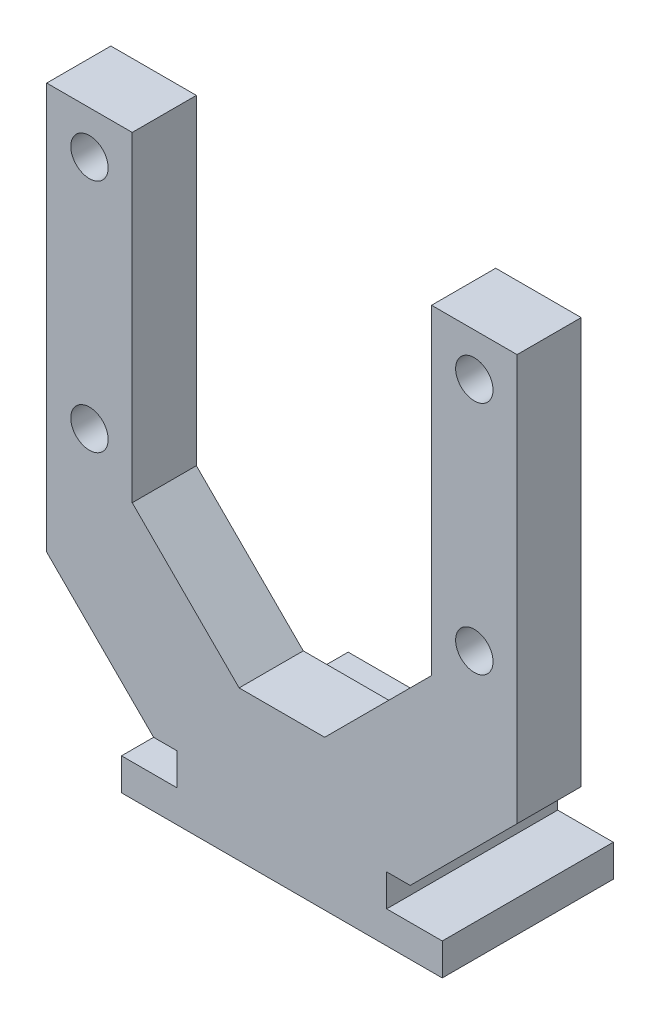
ISO-10303-21;
HEADER;
FILE_DESCRIPTION(('STEP AP214'),'2;1');
FILE_NAME('part.step','',(''),(''),'','','');
FILE_SCHEMA(('AUTOMOTIVE_DESIGN { 1 0 10303 214 1 1 1 1 }'));
ENDSEC;
DATA;
#1=APPLICATION_CONTEXT('core data for automotive mechanical design processes');
#2=APPLICATION_PROTOCOL_DEFINITION('international standard','automotive_design',2000,#1);
#3=PRODUCT_CONTEXT('',#1,'mechanical');
#4=PRODUCT('Part','Part','',(#3));
#5=PRODUCT_RELATED_PRODUCT_CATEGORY('part','',(#4));
#6=PRODUCT_DEFINITION_FORMATION('','',#4);
#7=PRODUCT_DEFINITION_CONTEXT('part definition',#1,'design');
#8=PRODUCT_DEFINITION('design','',#6,#7);
#9=PRODUCT_DEFINITION_SHAPE('','',#8);
#10=(LENGTH_UNIT() NAMED_UNIT(*) SI_UNIT(.MILLI.,.METRE.));
#11=(NAMED_UNIT(*) PLANE_ANGLE_UNIT() SI_UNIT($,.RADIAN.));
#12=(NAMED_UNIT(*) SI_UNIT($,.STERADIAN.) SOLID_ANGLE_UNIT());
#13=UNCERTAINTY_MEASURE_WITH_UNIT(LENGTH_MEASURE(1.E-05),#10,'distance_accuracy_value','');
#14=(GEOMETRIC_REPRESENTATION_CONTEXT(3) GLOBAL_UNCERTAINTY_ASSIGNED_CONTEXT((#13)) GLOBAL_UNIT_ASSIGNED_CONTEXT((#10,
#11,#12)) REPRESENTATION_CONTEXT('',''));
#15=CARTESIAN_POINT('',(0.,0.,0.));
#16=DIRECTION('',(0.,0.,1.));
#17=DIRECTION('',(1.,0.,0.));
#18=AXIS2_PLACEMENT_3D('',#15,#16,#17);
#19=CARTESIAN_POINT('',(4.9,0.,3.));
#20=DIRECTION('',(1.,0.,0.));
#21=DIRECTION('',(0.,1.,0.));
#22=AXIS2_PLACEMENT_3D('',#19,#20,#21);
#23=PLANE('',#22);
#24=DIRECTION('',(0.,0.,-1.));
#25=VECTOR('',#24,1.);
#26=CARTESIAN_POINT('',(4.9,1.5000000000001,3.));
#27=LINE('',#26,#25);
#28=CARTESIAN_POINT('',(4.9,1.5000000000001,3.));
#29=VERTEX_POINT('',#28);
#30=CARTESIAN_POINT('',(4.9,1.5000000000001,-5.));
#31=VERTEX_POINT('',#30);
#32=EDGE_CURVE('E209',#29,#31,#27,.T.);
#33=ORIENTED_EDGE('',*,*,#32,.T.);
#34=DIRECTION('',(0.,-1.,0.));
#35=VECTOR('',#34,1.);
#36=CARTESIAN_POINT('',(4.9,0.,-5.));
#37=LINE('',#36,#35);
#38=CARTESIAN_POINT('',(4.9,3.0000000000001,-5.));
#39=VERTEX_POINT('',#38);
#40=EDGE_CURVE('E207',#39,#31,#37,.T.);
#41=ORIENTED_EDGE('',*,*,#40,.F.);
#42=DIRECTION('',(0.,0.,1.));
#43=VECTOR('',#42,1.);
#44=CARTESIAN_POINT('',(4.9,3.0000000000001,-5.));
#45=LINE('',#44,#43);
#46=CARTESIAN_POINT('',(4.9,3.0000000000001,-0.999999999999997));
#47=VERTEX_POINT('',#46);
#48=EDGE_CURVE('E195',#39,#47,#45,.T.);
#49=ORIENTED_EDGE('',*,*,#48,.T.);
#50=DIRECTION('',(0.,0.707106781186551,0.707106781186544));
#51=VECTOR('',#50,1.);
#52=CARTESIAN_POINT('',(4.9,4.00000000000008,0.));
#53=LINE('',#52,#51);
#54=CARTESIAN_POINT('',(4.9,4.00000000000011,0.));
#55=VERTEX_POINT('',#54);
#56=EDGE_CURVE('E11',#47,#55,#53,.T.);
#57=ORIENTED_EDGE('',*,*,#56,.T.);
#58=DIRECTION('',(0.,1.,0.));
#59=VECTOR('',#58,1.);
#60=CARTESIAN_POINT('',(4.9,0.,0.));
#61=LINE('',#60,#59);
#62=CARTESIAN_POINT('',(4.9,3.0000000000001,0.));
#63=VERTEX_POINT('',#62);
#64=EDGE_CURVE('E55',#63,#55,#61,.T.);
#65=ORIENTED_EDGE('',*,*,#64,.F.);
#66=DIRECTION('',(0.,0.,-1.));
#67=VECTOR('',#66,1.);
#68=CARTESIAN_POINT('',(4.9,3.0000000000001,3.));
#69=LINE('',#68,#67);
#70=CARTESIAN_POINT('',(4.9,3.0000000000001,3.));
#71=VERTEX_POINT('',#70);
#72=EDGE_CURVE('E345',#71,#63,#69,.T.);
#73=ORIENTED_EDGE('',*,*,#72,.F.);
#74=DIRECTION('',(0.,-1.,0.));
#75=VECTOR('',#74,1.);
#76=CARTESIAN_POINT('',(4.9,0.,3.));
#77=LINE('',#76,#75);
#78=EDGE_CURVE('E239',#71,#29,#77,.T.);
#79=ORIENTED_EDGE('',*,*,#78,.T.);
#80=EDGE_LOOP('',(#33,#41,#49,#57,#65,#73,#79));
#81=FACE_BOUND('',#80,.T.);
#82=ADVANCED_FACE('F40',(#81),#23,.T.);
#83=CARTESIAN_POINT('',(0.,3.00000000000005,3.));
#84=DIRECTION('',(0.,-1.,0.));
#85=DIRECTION('',(1.,0.,0.));
#86=AXIS2_PLACEMENT_3D('',#83,#84,#85);
#87=PLANE('',#86);
#88=DIRECTION('',(-1.,0.,0.));
#89=VECTOR('',#88,1.);
#90=CARTESIAN_POINT('',(0.,3.00000000000005,0.));
#91=LINE('',#90,#89);
#92=CARTESIAN_POINT('',(6.00000000000014,3.00000000000011,0.));
#93=VERTEX_POINT('',#92);
#94=EDGE_CURVE('E237',#93,#63,#91,.T.);
#95=ORIENTED_EDGE('',*,*,#94,.F.);
#96=DIRECTION('',(0.,0.,1.));
#97=VECTOR('',#96,1.);
#98=CARTESIAN_POINT('',(6.00000000000014,3.00000000000011,3.));
#99=LINE('',#98,#97);
#100=CARTESIAN_POINT('',(6.00000000000014,3.00000000000011,3.));
#101=VERTEX_POINT('',#100);
#102=EDGE_CURVE('E364',#93,#101,#99,.T.);
#103=ORIENTED_EDGE('',*,*,#102,.T.);
#104=DIRECTION('',(-1.,0.,0.));
#105=VECTOR('',#104,1.);
#106=CARTESIAN_POINT('',(0.,3.00000000000005,3.));
#107=LINE('',#106,#105);
#108=EDGE_CURVE('E241',#101,#71,#107,.T.);
#109=ORIENTED_EDGE('',*,*,#108,.T.);
#110=ORIENTED_EDGE('',*,*,#72,.T.);
#111=EDGE_LOOP('',(#95,#103,#109,#110));
#112=FACE_BOUND('',#111,.T.);
#113=ADVANCED_FACE('F457',(#112),#87,.T.);
#114=CARTESIAN_POINT('',(11.,0.,3.));
#115=DIRECTION('',(-1.,0.,0.));
#116=DIRECTION('',(0.,-1.,0.));
#117=AXIS2_PLACEMENT_3D('',#114,#115,#116);
#118=PLANE('',#117);
#119=DIRECTION('',(0.,1.,0.));
#120=VECTOR('',#119,1.);
#121=CARTESIAN_POINT('',(11.,0.,3.));
#122=LINE('',#121,#120);
#123=CARTESIAN_POINT('',(11.,8.00000000000004,3.));
#124=VERTEX_POINT('',#123);
#125=CARTESIAN_POINT('',(11.,27.,3.));
#126=VERTEX_POINT('',#125);
#127=EDGE_CURVE('E244',#124,#126,#122,.T.);
#128=ORIENTED_EDGE('',*,*,#127,.F.);
#129=DIRECTION('',(0.,0.,-1.));
#130=VECTOR('',#129,1.);
#131=CARTESIAN_POINT('',(11.,8.00000000000004,0.));
#132=LINE('',#131,#130);
#133=CARTESIAN_POINT('',(11.,8.00000000000004,0.));
#134=VERTEX_POINT('',#133);
#135=EDGE_CURVE('E361',#124,#134,#132,.T.);
#136=ORIENTED_EDGE('',*,*,#135,.T.);
#137=DIRECTION('',(0.,1.,0.));
#138=VECTOR('',#137,1.);
#139=CARTESIAN_POINT('',(11.,0.,0.));
#140=LINE('',#139,#138);
#141=CARTESIAN_POINT('',(11.,27.,0.));
#142=VERTEX_POINT('',#141);
#143=EDGE_CURVE('E290',#134,#142,#140,.T.);
#144=ORIENTED_EDGE('',*,*,#143,.T.);
#145=DIRECTION('',(0.,0.,-1.));
#146=VECTOR('',#145,1.);
#147=CARTESIAN_POINT('',(11.,27.,3.));
#148=LINE('',#147,#146);
#149=EDGE_CURVE('E342',#126,#142,#148,.T.);
#150=ORIENTED_EDGE('',*,*,#149,.F.);
#151=EDGE_LOOP('',(#128,#136,#144,#150));
#152=FACE_BOUND('',#151,.T.);
#153=ADVANCED_FACE('F449',(#152),#118,.F.);
#154=CARTESIAN_POINT('',(0.,27.,3.));
#155=DIRECTION('',(0.,-1.,0.));
#156=DIRECTION('',(0.,0.,-1.));
#157=AXIS2_PLACEMENT_3D('',#154,#155,#156);
#158=PLANE('',#157);
#159=DIRECTION('',(-1.,0.,0.));
#160=VECTOR('',#159,1.);
#161=CARTESIAN_POINT('',(0.,27.,0.));
#162=LINE('',#161,#160);
#163=CARTESIAN_POINT('',(6.99999999999996,27.,0.));
#164=VERTEX_POINT('',#163);
#165=EDGE_CURVE('E293',#142,#164,#162,.T.);
#166=ORIENTED_EDGE('',*,*,#165,.T.);
#167=DIRECTION('',(0.,0.,-1.));
#168=VECTOR('',#167,1.);
#169=CARTESIAN_POINT('',(6.99999999999996,27.,3.));
#170=LINE('',#169,#168);
#171=CARTESIAN_POINT('',(6.99999999999996,27.,3.));
#172=VERTEX_POINT('',#171);
#173=EDGE_CURVE('E339',#172,#164,#170,.T.);
#174=ORIENTED_EDGE('',*,*,#173,.F.);
#175=DIRECTION('',(-1.,0.,0.));
#176=VECTOR('',#175,1.);
#177=CARTESIAN_POINT('',(0.,27.,3.));
#178=LINE('',#177,#176);
#179=EDGE_CURVE('E247',#126,#172,#178,.T.);
#180=ORIENTED_EDGE('',*,*,#179,.F.);
#181=ORIENTED_EDGE('',*,*,#149,.T.);
#182=EDGE_LOOP('',(#166,#174,#180,#181));
#183=FACE_BOUND('',#182,.T.);
#184=ADVANCED_FACE('F443',(#183),#158,.F.);
#185=CARTESIAN_POINT('',(6.99999999999988,0.,3.));
#186=DIRECTION('',(-1.,0.,0.));
#187=DIRECTION('',(0.,-1.,0.));
#188=AXIS2_PLACEMENT_3D('',#185,#186,#187);
#189=PLANE('',#188);
#190=DIRECTION('',(0.,1.,0.));
#191=VECTOR('',#190,1.);
#192=CARTESIAN_POINT('',(6.99999999999988,0.,0.));
#193=LINE('',#192,#191);
#194=CARTESIAN_POINT('',(6.99999999999992,12.,0.));
#195=VERTEX_POINT('',#194);
#196=EDGE_CURVE('E296',#195,#164,#193,.T.);
#197=ORIENTED_EDGE('',*,*,#196,.F.);
#198=DIRECTION('',(0.,0.,1.));
#199=VECTOR('',#198,1.);
#200=CARTESIAN_POINT('',(6.99999999999992,12.,3.));
#201=LINE('',#200,#199);
#202=CARTESIAN_POINT('',(6.99999999999992,12.,3.));
#203=VERTEX_POINT('',#202);
#204=EDGE_CURVE('E371',#195,#203,#201,.T.);
#205=ORIENTED_EDGE('',*,*,#204,.T.);
#206=DIRECTION('',(0.,1.,0.));
#207=VECTOR('',#206,1.);
#208=CARTESIAN_POINT('',(6.99999999999988,0.,3.));
#209=LINE('',#208,#207);
#210=EDGE_CURVE('E250',#203,#172,#209,.T.);
#211=ORIENTED_EDGE('',*,*,#210,.T.);
#212=ORIENTED_EDGE('',*,*,#173,.T.);
#213=EDGE_LOOP('',(#197,#205,#211,#212));
#214=FACE_BOUND('',#213,.T.);
#215=ADVANCED_FACE('F438',(#214),#189,.T.);
#216=CARTESIAN_POINT('',(0.,7.,3.));
#217=DIRECTION('',(0.,1.,0.));
#218=DIRECTION('',(0.,0.,1.));
#219=AXIS2_PLACEMENT_3D('',#216,#217,#218);
#220=PLANE('',#219);
#221=DIRECTION('',(1.,0.,0.));
#222=VECTOR('',#221,1.);
#223=CARTESIAN_POINT('',(0.,7.,3.));
#224=LINE('',#223,#222);
#225=CARTESIAN_POINT('',(-1.99999999999992,7.,3.));
#226=VERTEX_POINT('',#225);
#227=CARTESIAN_POINT('',(1.99999999999986,7.,3.));
#228=VERTEX_POINT('',#227);
#229=EDGE_CURVE('E252',#226,#228,#224,.T.);
#230=ORIENTED_EDGE('',*,*,#229,.T.);
#231=DIRECTION('',(0.,0.,-1.));
#232=VECTOR('',#231,1.);
#233=CARTESIAN_POINT('',(1.99999999999986,7.,0.));
#234=LINE('',#233,#232);
#235=CARTESIAN_POINT('',(1.99999999999986,7.,0.));
#236=VERTEX_POINT('',#235);
#237=EDGE_CURVE('E368',#228,#236,#234,.T.);
#238=ORIENTED_EDGE('',*,*,#237,.T.);
#239=DIRECTION('',(1.,0.,0.));
#240=VECTOR('',#239,1.);
#241=CARTESIAN_POINT('',(0.,7.,0.));
#242=LINE('',#241,#240);
#243=CARTESIAN_POINT('',(-1.99999999999992,7.,0.));
#244=VERTEX_POINT('',#243);
#245=EDGE_CURVE('E298',#244,#236,#242,.T.);
#246=ORIENTED_EDGE('',*,*,#245,.F.);
#247=DIRECTION('',(0.,0.,1.));
#248=VECTOR('',#247,1.);
#249=CARTESIAN_POINT('',(-1.99999999999992,7.,3.));
#250=LINE('',#249,#248);
#251=EDGE_CURVE('E366',#244,#226,#250,.T.);
#252=ORIENTED_EDGE('',*,*,#251,.T.);
#253=EDGE_LOOP('',(#230,#238,#246,#252));
#254=FACE_BOUND('',#253,.T.);
#255=ADVANCED_FACE('F428',(#254),#220,.T.);
#256=CARTESIAN_POINT('',(-6.99999999999988,0.,3.));
#257=DIRECTION('',(1.,0.,0.));
#258=DIRECTION('',(0.,1.,0.));
#259=AXIS2_PLACEMENT_3D('',#256,#257,#258);
#260=PLANE('',#259);
#261=DIRECTION('',(0.,-1.,0.));
#262=VECTOR('',#261,1.);
#263=CARTESIAN_POINT('',(-6.99999999999988,0.,3.));
#264=LINE('',#263,#262);
#265=CARTESIAN_POINT('',(-6.99999999999996,27.,3.));
#266=VERTEX_POINT('',#265);
#267=CARTESIAN_POINT('',(-6.99999999999992,12.0000000000001,3.));
#268=VERTEX_POINT('',#267);
#269=EDGE_CURVE('E255',#266,#268,#264,.T.);
#270=ORIENTED_EDGE('',*,*,#269,.T.);
#271=DIRECTION('',(0.,0.,-1.));
#272=VECTOR('',#271,1.);
#273=CARTESIAN_POINT('',(-6.99999999999992,12.0000000000001,0.));
#274=LINE('',#273,#272);
#275=CARTESIAN_POINT('',(-6.99999999999992,12.0000000000001,0.));
#276=VERTEX_POINT('',#275);
#277=EDGE_CURVE('E373',#268,#276,#274,.T.);
#278=ORIENTED_EDGE('',*,*,#277,.T.);
#279=DIRECTION('',(0.,-1.,0.));
#280=VECTOR('',#279,1.);
#281=CARTESIAN_POINT('',(-6.99999999999988,0.,0.));
#282=LINE('',#281,#280);
#283=CARTESIAN_POINT('',(-6.99999999999996,27.,0.));
#284=VERTEX_POINT('',#283);
#285=EDGE_CURVE('E301',#284,#276,#282,.T.);
#286=ORIENTED_EDGE('',*,*,#285,.F.);
#287=DIRECTION('',(0.,0.,-1.));
#288=VECTOR('',#287,1.);
#289=CARTESIAN_POINT('',(-6.99999999999996,27.,3.));
#290=LINE('',#289,#288);
#291=EDGE_CURVE('E337',#266,#284,#290,.T.);
#292=ORIENTED_EDGE('',*,*,#291,.F.);
#293=EDGE_LOOP('',(#270,#278,#286,#292));
#294=FACE_BOUND('',#293,.T.);
#295=ADVANCED_FACE('F420',(#294),#260,.T.);
#296=CARTESIAN_POINT('',(0.,27.,3.));
#297=DIRECTION('',(0.,-1.,0.));
#298=DIRECTION('',(1.,0.,0.));
#299=AXIS2_PLACEMENT_3D('',#296,#297,#298);
#300=PLANE('',#299);
#301=DIRECTION('',(-1.,0.,0.));
#302=VECTOR('',#301,1.);
#303=CARTESIAN_POINT('',(0.,27.,0.));
#304=LINE('',#303,#302);
#305=CARTESIAN_POINT('',(-11.,27.,0.));
#306=VERTEX_POINT('',#305);
#307=EDGE_CURVE('E304',#284,#306,#304,.T.);
#308=ORIENTED_EDGE('',*,*,#307,.T.);
#309=DIRECTION('',(0.,0.,-1.));
#310=VECTOR('',#309,1.);
#311=CARTESIAN_POINT('',(-11.,27.,3.));
#312=LINE('',#311,#310);
#313=CARTESIAN_POINT('',(-11.,27.,3.));
#314=VERTEX_POINT('',#313);
#315=EDGE_CURVE('E334',#314,#306,#312,.T.);
#316=ORIENTED_EDGE('',*,*,#315,.F.);
#317=DIRECTION('',(-1.,0.,0.));
#318=VECTOR('',#317,1.);
#319=CARTESIAN_POINT('',(0.,27.,3.));
#320=LINE('',#319,#318);
#321=EDGE_CURVE('E258',#266,#314,#320,.T.);
#322=ORIENTED_EDGE('',*,*,#321,.F.);
#323=ORIENTED_EDGE('',*,*,#291,.T.);
#324=EDGE_LOOP('',(#308,#316,#322,#323));
#325=FACE_BOUND('',#324,.T.);
#326=ADVANCED_FACE('F416',(#325),#300,.F.);
#327=CARTESIAN_POINT('',(-11.,0.,3.));
#328=DIRECTION('',(1.,0.,0.));
#329=DIRECTION('',(0.,1.,0.));
#330=AXIS2_PLACEMENT_3D('',#327,#328,#329);
#331=PLANE('',#330);
#332=DIRECTION('',(0.,-1.,0.));
#333=VECTOR('',#332,1.);
#334=CARTESIAN_POINT('',(-11.,0.,0.));
#335=LINE('',#334,#333);
#336=CARTESIAN_POINT('',(-11.,8.00000000000002,0.));
#337=VERTEX_POINT('',#336);
#338=EDGE_CURVE('E306',#306,#337,#335,.T.);
#339=ORIENTED_EDGE('',*,*,#338,.T.);
#340=DIRECTION('',(0.,0.,1.));
#341=VECTOR('',#340,1.);
#342=CARTESIAN_POINT('',(-11.,8.00000000000002,3.));
#343=LINE('',#342,#341);
#344=CARTESIAN_POINT('',(-11.,8.00000000000002,3.));
#345=VERTEX_POINT('',#344);
#346=EDGE_CURVE('E355',#337,#345,#343,.T.);
#347=ORIENTED_EDGE('',*,*,#346,.T.);
#348=DIRECTION('',(0.,-1.,0.));
#349=VECTOR('',#348,1.);
#350=CARTESIAN_POINT('',(-11.,0.,3.));
#351=LINE('',#350,#349);
#352=EDGE_CURVE('E260',#314,#345,#351,.T.);
#353=ORIENTED_EDGE('',*,*,#352,.F.);
#354=ORIENTED_EDGE('',*,*,#315,.T.);
#355=EDGE_LOOP('',(#339,#347,#353,#354));
#356=FACE_BOUND('',#355,.T.);
#357=ADVANCED_FACE('F411',(#356),#331,.F.);
#358=CARTESIAN_POINT('',(-4.9,3.,3.));
#359=VERTEX_POINT('',#358);
#360=CARTESIAN_POINT('',(-5.99999999999998,2.99999999999999,3.));
#361=VERTEX_POINT('',#360);
#362=EDGE_CURVE('E245',#359,#361,#107,.T.);
#363=ORIENTED_EDGE('',*,*,#362,.T.);
#364=DIRECTION('',(0.,0.,-1.));
#365=VECTOR('',#364,1.);
#366=CARTESIAN_POINT('',(-5.99999999999998,2.99999999999999,0.));
#367=LINE('',#366,#365);
#368=CARTESIAN_POINT('',(-5.99999999999998,2.99999999999999,0.));
#369=VERTEX_POINT('',#368);
#370=EDGE_CURVE('E348',#361,#369,#367,.T.);
#371=ORIENTED_EDGE('',*,*,#370,.T.);
#372=CARTESIAN_POINT('',(-4.9,3.,0.));
#373=VERTEX_POINT('',#372);
#374=EDGE_CURVE('E291',#373,#369,#91,.T.);
#375=ORIENTED_EDGE('',*,*,#374,.F.);
#376=DIRECTION('',(0.,0.,-1.));
#377=VECTOR('',#376,1.);
#378=CARTESIAN_POINT('',(-4.9,3.,3.));
#379=LINE('',#378,#377);
#380=EDGE_CURVE('E331',#359,#373,#379,.T.);
#381=ORIENTED_EDGE('',*,*,#380,.F.);
#382=EDGE_LOOP('',(#363,#371,#375,#381));
#383=FACE_BOUND('',#382,.T.);
#384=ADVANCED_FACE('F402',(#383),#87,.T.);
#385=CARTESIAN_POINT('',(-4.9,0.,3.));
#386=DIRECTION('',(1.,0.,0.));
#387=DIRECTION('',(0.,1.,0.));
#388=AXIS2_PLACEMENT_3D('',#385,#386,#387);
#389=PLANE('',#388);
#390=ORIENTED_EDGE('',*,*,#380,.T.);
#391=DIRECTION('',(0.,-1.,0.));
#392=VECTOR('',#391,1.);
#393=CARTESIAN_POINT('',(-4.9,0.,0.));
#394=LINE('',#393,#392);
#395=CARTESIAN_POINT('',(-4.9,4.00000000000001,0.));
#396=VERTEX_POINT('',#395);
#397=EDGE_CURVE('E388',#396,#373,#394,.T.);
#398=ORIENTED_EDGE('',*,*,#397,.F.);
#399=DIRECTION('',(0.,-0.707106781186551,-0.707106781186544));
#400=VECTOR('',#399,1.);
#401=CARTESIAN_POINT('',(-4.9,3.49999999999998,-0.500000000000017));
#402=LINE('',#401,#400);
#403=CARTESIAN_POINT('',(-4.9,3.,-0.999999999999997));
#404=VERTEX_POINT('',#403);
#405=EDGE_CURVE('E49',#396,#404,#402,.T.);
#406=ORIENTED_EDGE('',*,*,#405,.T.);
#407=DIRECTION('',(0.,0.,1.));
#408=VECTOR('',#407,1.);
#409=CARTESIAN_POINT('',(-4.9,3.,-5.));
#410=LINE('',#409,#408);
#411=CARTESIAN_POINT('',(-4.9,3.,-5.));
#412=VERTEX_POINT('',#411);
#413=EDGE_CURVE('E203',#412,#404,#410,.T.);
#414=ORIENTED_EDGE('',*,*,#413,.F.);
#415=DIRECTION('',(0.,-1.,0.));
#416=VECTOR('',#415,1.);
#417=CARTESIAN_POINT('',(-4.9,0.,-5.));
#418=LINE('',#417,#416);
#419=CARTESIAN_POINT('',(-4.9,1.5000000000001,-5.));
#420=VERTEX_POINT('',#419);
#421=EDGE_CURVE('E219',#412,#420,#418,.T.);
#422=ORIENTED_EDGE('',*,*,#421,.T.);
#423=DIRECTION('',(0.,0.,-1.));
#424=VECTOR('',#423,1.);
#425=CARTESIAN_POINT('',(-4.9,1.5000000000001,3.));
#426=LINE('',#425,#424);
#427=CARTESIAN_POINT('',(-4.9,1.5000000000001,3.));
#428=VERTEX_POINT('',#427);
#429=EDGE_CURVE('E329',#428,#420,#426,.T.);
#430=ORIENTED_EDGE('',*,*,#429,.F.);
#431=DIRECTION('',(0.,-1.,0.));
#432=VECTOR('',#431,1.);
#433=CARTESIAN_POINT('',(-4.9,0.,3.));
#434=LINE('',#433,#432);
#435=EDGE_CURVE('E263',#359,#428,#434,.T.);
#436=ORIENTED_EDGE('',*,*,#435,.F.);
#437=EDGE_LOOP('',(#390,#398,#406,#414,#422,#430,#436));
#438=FACE_BOUND('',#437,.T.);
#439=ADVANCED_FACE('F397',(#438),#389,.F.);
#440=CARTESIAN_POINT('',(0.,1.50000000000029,3.));
#441=DIRECTION('',(0.,-1.,0.));
#442=DIRECTION('',(1.,0.,0.));
#443=AXIS2_PLACEMENT_3D('',#440,#441,#442);
#444=PLANE('',#443);
#445=ORIENTED_EDGE('',*,*,#429,.T.);
#446=DIRECTION('',(-1.,0.,0.));
#447=VECTOR('',#446,1.);
#448=CARTESIAN_POINT('',(0.,1.50000000000029,-5.));
#449=LINE('',#448,#447);
#450=CARTESIAN_POINT('',(-7.4999999999999,1.5,-5.));
#451=VERTEX_POINT('',#450);
#452=EDGE_CURVE('E221',#420,#451,#449,.T.);
#453=ORIENTED_EDGE('',*,*,#452,.T.);
#454=DIRECTION('',(0.,0.,-1.));
#455=VECTOR('',#454,1.);
#456=CARTESIAN_POINT('',(-7.4999999999999,1.5,3.));
#457=LINE('',#456,#455);
#458=CARTESIAN_POINT('',(-7.4999999999999,1.5,3.));
#459=VERTEX_POINT('',#458);
#460=EDGE_CURVE('E327',#459,#451,#457,.T.);
#461=ORIENTED_EDGE('',*,*,#460,.F.);
#462=DIRECTION('',(-1.,0.,0.));
#463=VECTOR('',#462,1.);
#464=CARTESIAN_POINT('',(0.,1.50000000000029,3.));
#465=LINE('',#464,#463);
#466=EDGE_CURVE('E265',#428,#459,#465,.T.);
#467=ORIENTED_EDGE('',*,*,#466,.F.);
#468=EDGE_LOOP('',(#445,#453,#461,#467));
#469=FACE_BOUND('',#468,.T.);
#470=ADVANCED_FACE('F482',(#469),#444,.F.);
#471=CARTESIAN_POINT('',(-7.4999999999999,0.,3.));
#472=DIRECTION('',(1.,0.,0.));
#473=DIRECTION('',(0.,0.,-1.));
#474=AXIS2_PLACEMENT_3D('',#471,#472,#473);
#475=PLANE('',#474);
#476=ORIENTED_EDGE('',*,*,#460,.T.);
#477=DIRECTION('',(0.,-1.,0.));
#478=VECTOR('',#477,1.);
#479=CARTESIAN_POINT('',(-7.4999999999999,0.,-5.));
#480=LINE('',#479,#478);
#481=CARTESIAN_POINT('',(-7.4999999999999,0.,-5.));
#482=VERTEX_POINT('',#481);
#483=EDGE_CURVE('E227',#451,#482,#480,.T.);
#484=ORIENTED_EDGE('',*,*,#483,.T.);
#485=DIRECTION('',(0.,0.,-1.));
#486=VECTOR('',#485,1.);
#487=CARTESIAN_POINT('',(-7.4999999999999,0.,3.));
#488=LINE('',#487,#486);
#489=CARTESIAN_POINT('',(-7.4999999999999,0.,3.));
#490=VERTEX_POINT('',#489);
#491=EDGE_CURVE('E325',#490,#482,#488,.T.);
#492=ORIENTED_EDGE('',*,*,#491,.F.);
#493=DIRECTION('',(0.,-1.,0.));
#494=VECTOR('',#493,1.);
#495=CARTESIAN_POINT('',(-7.4999999999999,0.,3.));
#496=LINE('',#495,#494);
#497=EDGE_CURVE('E267',#459,#490,#496,.T.);
#498=ORIENTED_EDGE('',*,*,#497,.F.);
#499=EDGE_LOOP('',(#476,#484,#492,#498));
#500=FACE_BOUND('',#499,.T.);
#501=ADVANCED_FACE('F477',(#500),#475,.F.);
#502=CARTESIAN_POINT('',(0.,0.,3.));
#503=DIRECTION('',(0.,1.,0.));
#504=DIRECTION('',(-1.,0.,0.));
#505=AXIS2_PLACEMENT_3D('',#502,#503,#504);
#506=PLANE('',#505);
#507=CARTESIAN_POINT('',(0.,-1.73472347597681E-13,-3.));
#508=DIRECTION('',(0.,1.,0.));
#509=DIRECTION('',(-1.,0.,0.));
#510=AXIS2_PLACEMENT_3D('',#507,#508,#509);
#511=CIRCLE('',#510,1.5);
#512=CARTESIAN_POINT('',(-1.5,-1.90096780909125E-13,-3.));
#513=VERTEX_POINT('',#512);
#514=EDGE_CURVE('E213',#513,#513,#511,.T.);
#515=ORIENTED_EDGE('',*,*,#514,.T.);
#516=EDGE_LOOP('',(#515));
#517=FACE_BOUND('',#516,.T.);
#518=ORIENTED_EDGE('',*,*,#491,.T.);
#519=DIRECTION('',(1.,0.,0.));
#520=VECTOR('',#519,1.);
#521=CARTESIAN_POINT('',(0.,0.,-5.));
#522=LINE('',#521,#520);
#523=CARTESIAN_POINT('',(7.5,0.,-5.));
#524=VERTEX_POINT('',#523);
#525=EDGE_CURVE('E230',#482,#524,#522,.T.);
#526=ORIENTED_EDGE('',*,*,#525,.T.);
#527=DIRECTION('',(0.,0.,-1.));
#528=VECTOR('',#527,1.);
#529=CARTESIAN_POINT('',(7.5,0.,3.));
#530=LINE('',#529,#528);
#531=CARTESIAN_POINT('',(7.5,0.,3.));
#532=VERTEX_POINT('',#531);
#533=EDGE_CURVE('E323',#532,#524,#530,.T.);
#534=ORIENTED_EDGE('',*,*,#533,.F.);
#535=DIRECTION('',(1.,0.,0.));
#536=VECTOR('',#535,1.);
#537=CARTESIAN_POINT('',(0.,0.,3.));
#538=LINE('',#537,#536);
#539=EDGE_CURVE('E269',#490,#532,#538,.T.);
#540=ORIENTED_EDGE('',*,*,#539,.F.);
#541=EDGE_LOOP('',(#518,#526,#534,#540));
#542=FACE_BOUND('',#541,.T.);
#543=ADVANCED_FACE('F473',(#517,#542),#506,.F.);
#544=CARTESIAN_POINT('',(7.5,5.07406616723217E-13,3.));
#545=DIRECTION('',(1.,0.,0.));
#546=DIRECTION('',(0.,1.,0.));
#547=AXIS2_PLACEMENT_3D('',#544,#545,#546);
#548=PLANE('',#547);
#549=ORIENTED_EDGE('',*,*,#533,.T.);
#550=DIRECTION('',(0.,-1.,0.));
#551=VECTOR('',#550,1.);
#552=CARTESIAN_POINT('',(7.5,5.07406616723217E-13,-5.));
#553=LINE('',#552,#551);
#554=CARTESIAN_POINT('',(7.4999999999999,1.5,-5.));
#555=VERTEX_POINT('',#554);
#556=EDGE_CURVE('E233',#555,#524,#553,.T.);
#557=ORIENTED_EDGE('',*,*,#556,.F.);
#558=DIRECTION('',(0.,0.,-1.));
#559=VECTOR('',#558,1.);
#560=CARTESIAN_POINT('',(7.4999999999999,1.5,3.));
#561=LINE('',#560,#559);
#562=CARTESIAN_POINT('',(7.4999999999999,1.5,3.));
#563=VERTEX_POINT('',#562);
#564=EDGE_CURVE('E321',#563,#555,#561,.T.);
#565=ORIENTED_EDGE('',*,*,#564,.F.);
#566=DIRECTION('',(0.,-1.,0.));
#567=VECTOR('',#566,1.);
#568=CARTESIAN_POINT('',(7.5,5.07406616723217E-13,3.));
#569=LINE('',#568,#567);
#570=EDGE_CURVE('E271',#563,#532,#569,.T.);
#571=ORIENTED_EDGE('',*,*,#570,.T.);
#572=EDGE_LOOP('',(#549,#557,#565,#571));
#573=FACE_BOUND('',#572,.T.);
#574=ADVANCED_FACE('F469',(#573),#548,.T.);
#575=CARTESIAN_POINT('',(9.00000000000001,25.,3.));
#576=DIRECTION('',(0.,0.,-1.));
#577=DIRECTION('',(-1.,0.,0.));
#578=AXIS2_PLACEMENT_3D('',#575,#576,#577);
#579=CYLINDRICAL_SURFACE('',#578,0.875);
#580=CARTESIAN_POINT('',(9.00000000000001,25.,3.));
#581=DIRECTION('',(0.,0.,1.));
#582=DIRECTION('',(1.,0.,0.));
#583=AXIS2_PLACEMENT_3D('',#580,#581,#582);
#584=CIRCLE('',#583,0.875);
#585=CARTESIAN_POINT('',(9.87500000000001,25.,3.));
#586=VERTEX_POINT('',#585);
#587=EDGE_CURVE('E283',#586,#586,#584,.T.);
#588=ORIENTED_EDGE('',*,*,#587,.T.);
#589=EDGE_LOOP('',(#588));
#590=FACE_BOUND('',#589,.T.);
#591=CARTESIAN_POINT('',(9.00000000000001,25.,0.));
#592=DIRECTION('',(0.,0.,1.));
#593=DIRECTION('',(1.,0.,0.));
#594=AXIS2_PLACEMENT_3D('',#591,#592,#593);
#595=CIRCLE('',#594,0.875);
#596=CARTESIAN_POINT('',(9.87500000000001,25.,0.));
#597=VERTEX_POINT('',#596);
#598=EDGE_CURVE('E315',#597,#597,#595,.T.);
#599=ORIENTED_EDGE('',*,*,#598,.F.);
#600=EDGE_LOOP('',(#599));
#601=FACE_BOUND('',#600,.T.);
#602=ADVANCED_FACE('F537',(#590,#601),#579,.F.);
#603=CARTESIAN_POINT('',(9.00000000000001,14.,3.));
#604=DIRECTION('',(0.,0.,-1.));
#605=DIRECTION('',(-1.,0.,0.));
#606=AXIS2_PLACEMENT_3D('',#603,#604,#605);
#607=CYLINDRICAL_SURFACE('',#606,0.875);
#608=CARTESIAN_POINT('',(9.00000000000001,14.,3.));
#609=DIRECTION('',(0.,0.,1.));
#610=DIRECTION('',(1.,0.,0.));
#611=AXIS2_PLACEMENT_3D('',#608,#609,#610);
#612=CIRCLE('',#611,0.875);
#613=CARTESIAN_POINT('',(9.87500000000001,14.,3.));
#614=VERTEX_POINT('',#613);
#615=EDGE_CURVE('E280',#614,#614,#612,.T.);
#616=ORIENTED_EDGE('',*,*,#615,.T.);
#617=EDGE_LOOP('',(#616));
#618=FACE_BOUND('',#617,.T.);
#619=CARTESIAN_POINT('',(9.00000000000001,14.,0.));
#620=DIRECTION('',(0.,0.,1.));
#621=DIRECTION('',(1.,0.,0.));
#622=AXIS2_PLACEMENT_3D('',#619,#620,#621);
#623=CIRCLE('',#622,0.875);
#624=CARTESIAN_POINT('',(9.87500000000001,14.,0.));
#625=VERTEX_POINT('',#624);
#626=EDGE_CURVE('E312',#625,#625,#623,.T.);
#627=ORIENTED_EDGE('',*,*,#626,.F.);
#628=EDGE_LOOP('',(#627));
#629=FACE_BOUND('',#628,.T.);
#630=ADVANCED_FACE('F540',(#618,#629),#607,.F.);
#631=CARTESIAN_POINT('',(-8.99999999999999,14.,3.));
#632=DIRECTION('',(0.,0.,-1.));
#633=DIRECTION('',(-1.,0.,0.));
#634=AXIS2_PLACEMENT_3D('',#631,#632,#633);
#635=CYLINDRICAL_SURFACE('',#634,0.875);
#636=CARTESIAN_POINT('',(-8.99999999999999,14.,3.));
#637=DIRECTION('',(0.,0.,1.));
#638=DIRECTION('',(1.,0.,0.));
#639=AXIS2_PLACEMENT_3D('',#636,#637,#638);
#640=CIRCLE('',#639,0.875);
#641=CARTESIAN_POINT('',(-8.12499999999999,14.,3.));
#642=VERTEX_POINT('',#641);
#643=EDGE_CURVE('E277',#642,#642,#640,.T.);
#644=ORIENTED_EDGE('',*,*,#643,.T.);
#645=EDGE_LOOP('',(#644));
#646=FACE_BOUND('',#645,.T.);
#647=CARTESIAN_POINT('',(-8.99999999999999,14.,0.));
#648=DIRECTION('',(0.,0.,1.));
#649=DIRECTION('',(1.,0.,0.));
#650=AXIS2_PLACEMENT_3D('',#647,#648,#649);
#651=CIRCLE('',#650,0.875);
#652=CARTESIAN_POINT('',(-8.12499999999999,14.,0.));
#653=VERTEX_POINT('',#652);
#654=EDGE_CURVE('E309',#653,#653,#651,.T.);
#655=ORIENTED_EDGE('',*,*,#654,.F.);
#656=EDGE_LOOP('',(#655));
#657=FACE_BOUND('',#656,.T.);
#658=ADVANCED_FACE('F544',(#646,#657),#635,.F.);
#659=CARTESIAN_POINT('',(0.,1.50000000000029,3.));
#660=DIRECTION('',(0.,1.,0.));
#661=DIRECTION('',(-1.,0.,0.));
#662=AXIS2_PLACEMENT_3D('',#659,#660,#661);
#663=PLANE('',#662);
#664=ORIENTED_EDGE('',*,*,#564,.T.);
#665=DIRECTION('',(1.,0.,0.));
#666=VECTOR('',#665,1.);
#667=CARTESIAN_POINT('',(0.,1.50000000000029,-5.));
#668=LINE('',#667,#666);
#669=EDGE_CURVE('E204',#31,#555,#668,.T.);
#670=ORIENTED_EDGE('',*,*,#669,.F.);
#671=ORIENTED_EDGE('',*,*,#32,.F.);
#672=DIRECTION('',(1.,0.,0.));
#673=VECTOR('',#672,1.);
#674=CARTESIAN_POINT('',(0.,1.50000000000029,3.));
#675=LINE('',#674,#673);
#676=EDGE_CURVE('E274',#29,#563,#675,.T.);
#677=ORIENTED_EDGE('',*,*,#676,.T.);
#678=EDGE_LOOP('',(#664,#670,#671,#677));
#679=FACE_BOUND('',#678,.T.);
#680=ADVANCED_FACE('F465',(#679),#663,.T.);
#681=CARTESIAN_POINT('',(-8.99999999999999,25.,3.));
#682=DIRECTION('',(0.,0.,-1.));
#683=DIRECTION('',(-1.,0.,0.));
#684=AXIS2_PLACEMENT_3D('',#681,#682,#683);
#685=CYLINDRICAL_SURFACE('',#684,0.875);
#686=CARTESIAN_POINT('',(-8.99999999999999,25.,3.));
#687=DIRECTION('',(0.,0.,1.));
#688=DIRECTION('',(1.,0.,0.));
#689=AXIS2_PLACEMENT_3D('',#686,#687,#688);
#690=CIRCLE('',#689,0.875);
#691=CARTESIAN_POINT('',(-8.12499999999999,25.,3.));
#692=VERTEX_POINT('',#691);
#693=EDGE_CURVE('E286',#692,#692,#690,.T.);
#694=ORIENTED_EDGE('',*,*,#693,.T.);
#695=EDGE_LOOP('',(#694));
#696=FACE_BOUND('',#695,.T.);
#697=CARTESIAN_POINT('',(-8.99999999999999,25.,0.));
#698=DIRECTION('',(0.,0.,1.));
#699=DIRECTION('',(1.,0.,0.));
#700=AXIS2_PLACEMENT_3D('',#697,#698,#699);
#701=CIRCLE('',#700,0.875);
#702=CARTESIAN_POINT('',(-8.12499999999999,25.,0.));
#703=VERTEX_POINT('',#702);
#704=EDGE_CURVE('E242',#703,#703,#701,.T.);
#705=ORIENTED_EDGE('',*,*,#704,.F.);
#706=EDGE_LOOP('',(#705));
#707=FACE_BOUND('',#706,.T.);
#708=ADVANCED_FACE('F531',(#696,#707),#685,.F.);
#709=CARTESIAN_POINT('',(0.,0.,3.));
#710=DIRECTION('',(0.,0.,1.));
#711=DIRECTION('',(1.,0.,0.));
#712=AXIS2_PLACEMENT_3D('',#709,#710,#711);
#713=PLANE('',#712);
#714=ORIENTED_EDGE('',*,*,#352,.T.);
#715=DIRECTION('',(0.707106781186547,-0.707106781186548,0.));
#716=VECTOR('',#715,1.);
#717=CARTESIAN_POINT('',(-1.5,-1.49999999999999,3.));
#718=LINE('',#717,#716);
#719=EDGE_CURVE('E359',#345,#361,#718,.T.);
#720=ORIENTED_EDGE('',*,*,#719,.T.);
#721=ORIENTED_EDGE('',*,*,#362,.F.);
#722=ORIENTED_EDGE('',*,*,#435,.T.);
#723=ORIENTED_EDGE('',*,*,#466,.T.);
#724=ORIENTED_EDGE('',*,*,#497,.T.);
#725=ORIENTED_EDGE('',*,*,#539,.T.);
#726=ORIENTED_EDGE('',*,*,#570,.F.);
#727=ORIENTED_EDGE('',*,*,#676,.F.);
#728=ORIENTED_EDGE('',*,*,#78,.F.);
#729=ORIENTED_EDGE('',*,*,#108,.F.);
#730=DIRECTION('',(0.707106781186542,0.707106781186553,0.));
#731=VECTOR('',#730,1.);
#732=CARTESIAN_POINT('',(1.50000000000007,-1.50000000000004,3.));
#733=LINE('',#732,#731);
#734=EDGE_CURVE('E357',#101,#124,#733,.T.);
#735=ORIENTED_EDGE('',*,*,#734,.T.);
#736=ORIENTED_EDGE('',*,*,#127,.T.);
#737=ORIENTED_EDGE('',*,*,#179,.T.);
#738=ORIENTED_EDGE('',*,*,#210,.F.);
#739=DIRECTION('',(0.707106781186553,0.707106781186542,0.));
#740=VECTOR('',#739,1.);
#741=CARTESIAN_POINT('',(1.99999999999986,7.,3.));
#742=LINE('',#741,#740);
#743=EDGE_CURVE('E378',#203,#228,#742,.F.);
#744=ORIENTED_EDGE('',*,*,#743,.T.);
#745=ORIENTED_EDGE('',*,*,#229,.F.);
#746=DIRECTION('',(0.707106781186544,-0.707106781186551,0.));
#747=VECTOR('',#746,1.);
#748=CARTESIAN_POINT('',(-6.99999999999992,12.0000000000001,3.));
#749=LINE('',#748,#747);
#750=EDGE_CURVE('E382',#226,#268,#749,.F.);
#751=ORIENTED_EDGE('',*,*,#750,.T.);
#752=ORIENTED_EDGE('',*,*,#269,.F.);
#753=ORIENTED_EDGE('',*,*,#321,.T.);
#754=EDGE_LOOP('',(#714,#720,#721,#722,#723,#724,#725,#726,#727,#728,#729,#735,#736,#737,#738,
#744,#745,#751,#752,#753));
#755=FACE_BOUND('',#754,.T.);
#756=ORIENTED_EDGE('',*,*,#643,.F.);
#757=EDGE_LOOP('',(#756));
#758=FACE_BOUND('',#757,.T.);
#759=ORIENTED_EDGE('',*,*,#615,.F.);
#760=EDGE_LOOP('',(#759));
#761=FACE_BOUND('',#760,.T.);
#762=ORIENTED_EDGE('',*,*,#587,.F.);
#763=EDGE_LOOP('',(#762));
#764=FACE_BOUND('',#763,.T.);
#765=ORIENTED_EDGE('',*,*,#693,.F.);
#766=EDGE_LOOP('',(#765));
#767=FACE_BOUND('',#766,.T.);
#768=ADVANCED_FACE('F460',(#755,#758,#761,#764,#767),#713,.T.);
#769=CARTESIAN_POINT('',(0.,0.,0.));
#770=DIRECTION('',(0.,0.,1.));
#771=DIRECTION('',(1.,0.,0.));
#772=AXIS2_PLACEMENT_3D('',#769,#770,#771);
#773=PLANE('',#772);
#774=DIRECTION('',(-1.,0.,0.));
#775=VECTOR('',#774,1.);
#776=CARTESIAN_POINT('',(0.,4.00000000000006,0.));
#777=LINE('',#776,#775);
#778=EDGE_CURVE('E385',#55,#396,#777,.T.);
#779=ORIENTED_EDGE('',*,*,#778,.T.);
#780=ORIENTED_EDGE('',*,*,#397,.T.);
#781=ORIENTED_EDGE('',*,*,#374,.T.);
#782=DIRECTION('',(-0.707106781186547,0.707106781186548,0.));
#783=VECTOR('',#782,1.);
#784=CARTESIAN_POINT('',(-5.99999999999998,2.99999999999999,0.));
#785=LINE('',#784,#783);
#786=EDGE_CURVE('E353',#369,#337,#785,.T.);
#787=ORIENTED_EDGE('',*,*,#786,.T.);
#788=ORIENTED_EDGE('',*,*,#338,.F.);
#789=ORIENTED_EDGE('',*,*,#307,.F.);
#790=ORIENTED_EDGE('',*,*,#285,.T.);
#791=DIRECTION('',(-0.707106781186544,0.707106781186551,0.));
#792=VECTOR('',#791,1.);
#793=CARTESIAN_POINT('',(2.50000000000003,2.50000000000001,0.));
#794=LINE('',#793,#792);
#795=EDGE_CURVE('E380',#276,#244,#794,.F.);
#796=ORIENTED_EDGE('',*,*,#795,.T.);
#797=ORIENTED_EDGE('',*,*,#245,.T.);
#798=DIRECTION('',(-0.707106781186553,-0.707106781186542,0.));
#799=VECTOR('',#798,1.);
#800=CARTESIAN_POINT('',(-2.50000000000009,2.50000000000013,0.));
#801=LINE('',#800,#799);
#802=EDGE_CURVE('E376',#236,#195,#801,.F.);
#803=ORIENTED_EDGE('',*,*,#802,.T.);
#804=ORIENTED_EDGE('',*,*,#196,.T.);
#805=ORIENTED_EDGE('',*,*,#165,.F.);
#806=ORIENTED_EDGE('',*,*,#143,.F.);
#807=DIRECTION('',(-0.707106781186542,-0.707106781186553,0.));
#808=VECTOR('',#807,1.);
#809=CARTESIAN_POINT('',(11.,8.00000000000004,0.));
#810=LINE('',#809,#808);
#811=EDGE_CURVE('E351',#134,#93,#810,.T.);
#812=ORIENTED_EDGE('',*,*,#811,.T.);
#813=ORIENTED_EDGE('',*,*,#94,.T.);
#814=ORIENTED_EDGE('',*,*,#64,.T.);
#815=EDGE_LOOP('',(#779,#780,#781,#787,#788,#789,#790,#796,#797,#803,#804,#805,#806,#812,#813,#814));
#816=FACE_BOUND('',#815,.T.);
#817=ORIENTED_EDGE('',*,*,#654,.T.);
#818=EDGE_LOOP('',(#817));
#819=FACE_BOUND('',#818,.T.);
#820=ORIENTED_EDGE('',*,*,#626,.T.);
#821=EDGE_LOOP('',(#820));
#822=FACE_BOUND('',#821,.T.);
#823=ORIENTED_EDGE('',*,*,#598,.T.);
#824=EDGE_LOOP('',(#823));
#825=FACE_BOUND('',#824,.T.);
#826=ORIENTED_EDGE('',*,*,#704,.T.);
#827=EDGE_LOOP('',(#826));
#828=FACE_BOUND('',#827,.T.);
#829=ADVANCED_FACE('F392',(#816,#819,#822,#825,#828),#773,.F.);
#830=CARTESIAN_POINT('',(-5.99999999999998,2.99999999999999,3.));
#831=DIRECTION('',(-0.707106781186548,-0.707106781186547,0.));
#832=DIRECTION('',(0.,0.,1.));
#833=AXIS2_PLACEMENT_3D('',#830,#831,#832);
#834=PLANE('',#833);
#835=ORIENTED_EDGE('',*,*,#719,.F.);
#836=ORIENTED_EDGE('',*,*,#346,.F.);
#837=ORIENTED_EDGE('',*,*,#786,.F.);
#838=ORIENTED_EDGE('',*,*,#370,.F.);
#839=EDGE_LOOP('',(#835,#836,#837,#838));
#840=FACE_BOUND('',#839,.T.);
#841=ADVANCED_FACE('F406',(#840),#834,.T.);
#842=CARTESIAN_POINT('',(11.,8.00000000000004,3.));
#843=DIRECTION('',(0.707106781186553,-0.707106781186542,0.));
#844=DIRECTION('',(0.,0.,1.));
#845=AXIS2_PLACEMENT_3D('',#842,#843,#844);
#846=PLANE('',#845);
#847=ORIENTED_EDGE('',*,*,#734,.F.);
#848=ORIENTED_EDGE('',*,*,#102,.F.);
#849=ORIENTED_EDGE('',*,*,#811,.F.);
#850=ORIENTED_EDGE('',*,*,#135,.F.);
#851=EDGE_LOOP('',(#847,#848,#849,#850));
#852=FACE_BOUND('',#851,.T.);
#853=ADVANCED_FACE('F453',(#852),#846,.T.);
#854=CARTESIAN_POINT('',(1.99999999999986,7.,3.));
#855=DIRECTION('',(-0.707106781186542,0.707106781186553,0.));
#856=DIRECTION('',(0.,0.,1.));
#857=AXIS2_PLACEMENT_3D('',#854,#855,#856);
#858=PLANE('',#857);
#859=ORIENTED_EDGE('',*,*,#743,.F.);
#860=ORIENTED_EDGE('',*,*,#204,.F.);
#861=ORIENTED_EDGE('',*,*,#802,.F.);
#862=ORIENTED_EDGE('',*,*,#237,.F.);
#863=EDGE_LOOP('',(#859,#860,#861,#862));
#864=FACE_BOUND('',#863,.T.);
#865=ADVANCED_FACE('F433',(#864),#858,.T.);
#866=CARTESIAN_POINT('',(-6.99999999999992,12.0000000000001,3.));
#867=DIRECTION('',(0.707106781186551,0.707106781186544,0.));
#868=DIRECTION('',(0.,0.,1.));
#869=AXIS2_PLACEMENT_3D('',#866,#867,#868);
#870=PLANE('',#869);
#871=ORIENTED_EDGE('',*,*,#750,.F.);
#872=ORIENTED_EDGE('',*,*,#251,.F.);
#873=ORIENTED_EDGE('',*,*,#795,.F.);
#874=ORIENTED_EDGE('',*,*,#277,.F.);
#875=EDGE_LOOP('',(#871,#872,#873,#874));
#876=FACE_BOUND('',#875,.T.);
#877=ADVANCED_FACE('F424',(#876),#870,.T.);
#878=CARTESIAN_POINT('',(0.,3.00000000000005,-5.));
#879=DIRECTION('',(0.,1.,0.));
#880=DIRECTION('',(-1.,0.,0.));
#881=AXIS2_PLACEMENT_3D('',#878,#879,#880);
#882=PLANE('',#881);
#883=CARTESIAN_POINT('',(0.,3.00000000000005,-3.));
#884=DIRECTION('',(0.,1.,0.));
#885=DIRECTION('',(-1.,0.,0.));
#886=AXIS2_PLACEMENT_3D('',#883,#884,#885);
#887=CIRCLE('',#886,1.5);
#888=CARTESIAN_POINT('',(-1.50000000000003,3.00000000000003,-3.));
#889=VERTEX_POINT('',#888);
#890=EDGE_CURVE('E787',#889,#889,#887,.T.);
#891=ORIENTED_EDGE('',*,*,#890,.F.);
#892=EDGE_LOOP('',(#891));
#893=FACE_BOUND('',#892,.T.);
#894=ORIENTED_EDGE('',*,*,#413,.T.);
#895=DIRECTION('',(1.,0.,0.));
#896=VECTOR('',#895,1.);
#897=CARTESIAN_POINT('',(0.,3.00000000000005,-0.999999999999997));
#898=LINE('',#897,#896);
#899=EDGE_CURVE('E201',#404,#47,#898,.T.);
#900=ORIENTED_EDGE('',*,*,#899,.T.);
#901=ORIENTED_EDGE('',*,*,#48,.F.);
#902=DIRECTION('',(-1.,0.,0.));
#903=VECTOR('',#902,1.);
#904=CARTESIAN_POINT('',(0.,3.00000000000005,-5.));
#905=LINE('',#904,#903);
#906=EDGE_CURVE('E199',#39,#412,#905,.T.);
#907=ORIENTED_EDGE('',*,*,#906,.T.);
#908=EDGE_LOOP('',(#894,#900,#901,#907));
#909=FACE_BOUND('',#908,.T.);
#910=ADVANCED_FACE('F197',(#893,#909),#882,.T.);
#911=CARTESIAN_POINT('',(0.,0.,-5.));
#912=DIRECTION('',(0.,0.,1.));
#913=DIRECTION('',(1.,0.,0.));
#914=AXIS2_PLACEMENT_3D('',#911,#912,#913);
#915=PLANE('',#914);
#916=ORIENTED_EDGE('',*,*,#40,.T.);
#917=ORIENTED_EDGE('',*,*,#669,.T.);
#918=ORIENTED_EDGE('',*,*,#556,.T.);
#919=ORIENTED_EDGE('',*,*,#525,.F.);
#920=ORIENTED_EDGE('',*,*,#483,.F.);
#921=ORIENTED_EDGE('',*,*,#452,.F.);
#922=ORIENTED_EDGE('',*,*,#421,.F.);
#923=ORIENTED_EDGE('',*,*,#906,.F.);
#924=EDGE_LOOP('',(#916,#917,#918,#919,#920,#921,#922,#923));
#925=FACE_BOUND('',#924,.T.);
#926=ADVANCED_FACE('F216',(#925),#915,.F.);
#927=CARTESIAN_POINT('',(0.,-1.73472347597681E-13,-3.));
#928=DIRECTION('',(0.,1.,0.));
#929=DIRECTION('',(-1.,0.,0.));
#930=AXIS2_PLACEMENT_3D('',#927,#928,#929);
#931=CYLINDRICAL_SURFACE('',#930,1.5);
#932=ORIENTED_EDGE('',*,*,#514,.F.);
#933=EDGE_LOOP('',(#932));
#934=FACE_BOUND('',#933,.T.);
#935=ORIENTED_EDGE('',*,*,#890,.T.);
#936=EDGE_LOOP('',(#935));
#937=FACE_BOUND('',#936,.T.);
#938=ADVANCED_FACE('F485',(#934,#937),#931,.F.);
#939=CARTESIAN_POINT('',(0.,4.00000000000006,0.));
#940=DIRECTION('',(0.,-0.707106781186544,0.707106781186551));
#941=DIRECTION('',(-1.,0.,0.));
#942=AXIS2_PLACEMENT_3D('',#939,#940,#941);
#943=PLANE('',#942);
#944=ORIENTED_EDGE('',*,*,#56,.F.);
#945=ORIENTED_EDGE('',*,*,#899,.F.);
#946=ORIENTED_EDGE('',*,*,#405,.F.);
#947=ORIENTED_EDGE('',*,*,#778,.F.);
#948=EDGE_LOOP('',(#944,#945,#946,#947));
#949=FACE_BOUND('',#948,.T.);
#950=ADVANCED_FACE('F43',(#949),#943,.F.);
#951=CLOSED_SHELL('',(#82,#113,#153,#184,#215,#255,#295,#326,#357,#384,#439,#470,#501,#543,#574,
#602,#630,#658,#680,#708,#768,#829,#841,#853,#865,#877,#910,#926,#938,#950));
#952=MANIFOLD_SOLID_BREP('B2',#951);
#953=ADVANCED_BREP_SHAPE_REPRESENTATION('',(#18,#952),#14);
#954=SHAPE_DEFINITION_REPRESENTATION(#9,#953);
ENDSEC;
END-ISO-10303-21;
